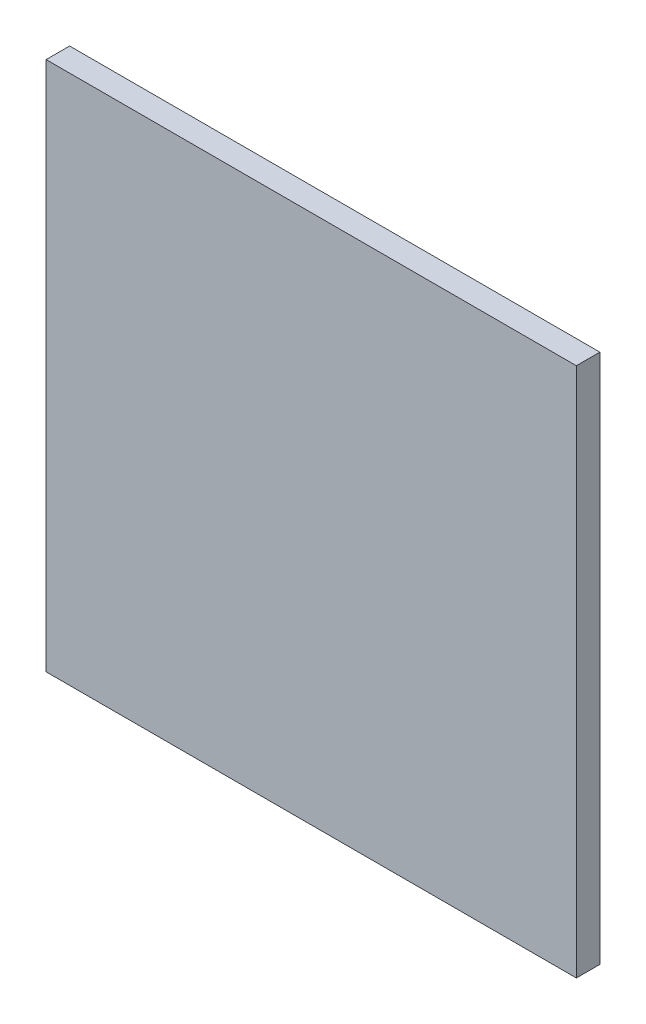
ISO-10303-21;
HEADER;
FILE_DESCRIPTION(('STEP AP214'),'2;1');
FILE_NAME('part.step','',(''),(''),'','','');
FILE_SCHEMA(('AUTOMOTIVE_DESIGN { 1 0 10303 214 1 1 1 1 }'));
ENDSEC;
DATA;
#1=APPLICATION_CONTEXT('core data for automotive mechanical design processes');
#2=APPLICATION_PROTOCOL_DEFINITION('international standard','automotive_design',2000,#1);
#3=PRODUCT_CONTEXT('',#1,'mechanical');
#4=PRODUCT('Part','Part','',(#3));
#5=PRODUCT_RELATED_PRODUCT_CATEGORY('part','',(#4));
#6=PRODUCT_DEFINITION_FORMATION('','',#4);
#7=PRODUCT_DEFINITION_CONTEXT('part definition',#1,'design');
#8=PRODUCT_DEFINITION('design','',#6,#7);
#9=PRODUCT_DEFINITION_SHAPE('','',#8);
#10=(LENGTH_UNIT() NAMED_UNIT(*) SI_UNIT(.MILLI.,.METRE.));
#11=(NAMED_UNIT(*) PLANE_ANGLE_UNIT() SI_UNIT($,.RADIAN.));
#12=(NAMED_UNIT(*) SI_UNIT($,.STERADIAN.) SOLID_ANGLE_UNIT());
#13=UNCERTAINTY_MEASURE_WITH_UNIT(LENGTH_MEASURE(1.E-05),#10,'distance_accuracy_value','');
#14=(GEOMETRIC_REPRESENTATION_CONTEXT(3) GLOBAL_UNCERTAINTY_ASSIGNED_CONTEXT((#13)) GLOBAL_UNIT_ASSIGNED_CONTEXT((#10,
#11,#12)) REPRESENTATION_CONTEXT('',''));
#15=CARTESIAN_POINT('',(0.,0.,0.));
#16=DIRECTION('',(0.,0.,1.));
#17=DIRECTION('',(1.,0.,0.));
#18=AXIS2_PLACEMENT_3D('',#15,#16,#17);
#19=CARTESIAN_POINT('',(5.07499874,5.07499874,0.4499991));
#20=DIRECTION('',(0.,0.,1.));
#21=DIRECTION('',(1.,0.,0.));
#22=AXIS2_PLACEMENT_3D('',#19,#20,#21);
#23=PLANE('',#22);
#24=DIRECTION('',(1.,0.,0.));
#25=VECTOR('',#24,1.);
#26=CARTESIAN_POINT('',(-5.07499874,5.07499874,0.4499991));
#27=LINE('',#26,#25);
#28=CARTESIAN_POINT('',(-5.07499874,5.07499874,0.4499991));
#29=VERTEX_POINT('',#28);
#30=CARTESIAN_POINT('',(5.07499874,5.07499874,0.4499991));
#31=VERTEX_POINT('',#30);
#32=EDGE_CURVE('E20',#29,#31,#27,.T.);
#33=ORIENTED_EDGE('',*,*,#32,.F.);
#34=DIRECTION('',(0.,1.,0.));
#35=VECTOR('',#34,1.);
#36=CARTESIAN_POINT('',(-5.07499874,-5.07499874,0.4499991));
#37=LINE('',#36,#35);
#38=CARTESIAN_POINT('',(-5.07499874,-5.07499874,0.4499991));
#39=VERTEX_POINT('',#38);
#40=EDGE_CURVE('E110',#39,#29,#37,.T.);
#41=ORIENTED_EDGE('',*,*,#40,.F.);
#42=DIRECTION('',(-1.,0.,0.));
#43=VECTOR('',#42,1.);
#44=CARTESIAN_POINT('',(5.07499874,-5.07499874,0.4499991));
#45=LINE('',#44,#43);
#46=CARTESIAN_POINT('',(5.07499874,-5.07499874,0.4499991));
#47=VERTEX_POINT('',#46);
#48=EDGE_CURVE('E83',#47,#39,#45,.T.);
#49=ORIENTED_EDGE('',*,*,#48,.F.);
#50=DIRECTION('',(0.,-1.,0.));
#51=VECTOR('',#50,1.);
#52=CARTESIAN_POINT('',(5.07499874,5.07499874,0.4499991));
#53=LINE('',#52,#51);
#54=EDGE_CURVE('E87',#31,#47,#53,.T.);
#55=ORIENTED_EDGE('',*,*,#54,.F.);
#56=EDGE_LOOP('',(#33,#41,#49,#55));
#57=FACE_BOUND('',#56,.T.);
#58=ADVANCED_FACE('F17',(#57),#23,.T.);
#59=CARTESIAN_POINT('',(5.07499874,5.07499874,0.));
#60=DIRECTION('',(0.,0.,1.));
#61=DIRECTION('',(1.,0.,0.));
#62=AXIS2_PLACEMENT_3D('',#59,#60,#61);
#63=PLANE('',#62);
#64=DIRECTION('',(0.,-1.,0.));
#65=VECTOR('',#64,1.);
#66=CARTESIAN_POINT('',(5.07499874,5.07499874,0.));
#67=LINE('',#66,#65);
#68=CARTESIAN_POINT('',(5.07499874,5.07499874,0.));
#69=VERTEX_POINT('',#68);
#70=CARTESIAN_POINT('',(5.07499874,-5.07499874,0.));
#71=VERTEX_POINT('',#70);
#72=EDGE_CURVE('E71',#69,#71,#67,.T.);
#73=ORIENTED_EDGE('',*,*,#72,.T.);
#74=DIRECTION('',(-1.,0.,0.));
#75=VECTOR('',#74,1.);
#76=CARTESIAN_POINT('',(5.07499874,-5.07499874,0.));
#77=LINE('',#76,#75);
#78=CARTESIAN_POINT('',(-5.07499874,-5.07499874,0.));
#79=VERTEX_POINT('',#78);
#80=EDGE_CURVE('E107',#71,#79,#77,.T.);
#81=ORIENTED_EDGE('',*,*,#80,.T.);
#82=DIRECTION('',(0.,1.,0.));
#83=VECTOR('',#82,1.);
#84=CARTESIAN_POINT('',(-5.07499874,-5.07499874,0.));
#85=LINE('',#84,#83);
#86=CARTESIAN_POINT('',(-5.07499874,5.07499874,0.));
#87=VERTEX_POINT('',#86);
#88=EDGE_CURVE('E73',#79,#87,#85,.T.);
#89=ORIENTED_EDGE('',*,*,#88,.T.);
#90=DIRECTION('',(1.,0.,0.));
#91=VECTOR('',#90,1.);
#92=CARTESIAN_POINT('',(-5.07499874,5.07499874,0.));
#93=LINE('',#92,#91);
#94=EDGE_CURVE('E11',#87,#69,#93,.T.);
#95=ORIENTED_EDGE('',*,*,#94,.T.);
#96=EDGE_LOOP('',(#73,#81,#89,#95));
#97=FACE_BOUND('',#96,.T.);
#98=ADVANCED_FACE('F69',(#97),#63,.F.);
#99=CARTESIAN_POINT('',(-5.07499874,5.07499874,0.));
#100=DIRECTION('',(0.,1.,0.));
#101=DIRECTION('',(1.,0.,0.));
#102=AXIS2_PLACEMENT_3D('',#99,#100,#101);
#103=PLANE('',#102);
#104=DIRECTION('',(0.,0.,1.));
#105=VECTOR('',#104,1.);
#106=CARTESIAN_POINT('',(-5.07499874,5.07499874,0.));
#107=LINE('',#106,#105);
#108=EDGE_CURVE('E97',#87,#29,#107,.T.);
#109=ORIENTED_EDGE('',*,*,#108,.T.);
#110=ORIENTED_EDGE('',*,*,#32,.T.);
#111=DIRECTION('',(0.,0.,1.));
#112=VECTOR('',#111,1.);
#113=CARTESIAN_POINT('',(5.07499874,5.07499874,0.));
#114=LINE('',#113,#112);
#115=EDGE_CURVE('E79',#69,#31,#114,.T.);
#116=ORIENTED_EDGE('',*,*,#115,.F.);
#117=ORIENTED_EDGE('',*,*,#94,.F.);
#118=EDGE_LOOP('',(#109,#110,#116,#117));
#119=FACE_BOUND('',#118,.T.);
#120=ADVANCED_FACE('F85',(#119),#103,.T.);
#121=CARTESIAN_POINT('',(-5.07499874,-5.07499874,0.));
#122=DIRECTION('',(-1.,0.,0.));
#123=DIRECTION('',(0.,0.,1.));
#124=AXIS2_PLACEMENT_3D('',#121,#122,#123);
#125=PLANE('',#124);
#126=DIRECTION('',(0.,0.,1.));
#127=VECTOR('',#126,1.);
#128=CARTESIAN_POINT('',(-5.07499874,-5.07499874,0.));
#129=LINE('',#128,#127);
#130=EDGE_CURVE('E103',#79,#39,#129,.T.);
#131=ORIENTED_EDGE('',*,*,#130,.T.);
#132=ORIENTED_EDGE('',*,*,#40,.T.);
#133=ORIENTED_EDGE('',*,*,#108,.F.);
#134=ORIENTED_EDGE('',*,*,#88,.F.);
#135=EDGE_LOOP('',(#131,#132,#133,#134));
#136=FACE_BOUND('',#135,.T.);
#137=ADVANCED_FACE('F117',(#136),#125,.T.);
#138=CARTESIAN_POINT('',(5.07499874,-5.07499874,0.));
#139=DIRECTION('',(0.,-1.,0.));
#140=DIRECTION('',(0.,0.,-1.));
#141=AXIS2_PLACEMENT_3D('',#138,#139,#140);
#142=PLANE('',#141);
#143=DIRECTION('',(0.,0.,1.));
#144=VECTOR('',#143,1.);
#145=CARTESIAN_POINT('',(5.07499874,-5.07499874,0.));
#146=LINE('',#145,#144);
#147=EDGE_CURVE('E81',#71,#47,#146,.T.);
#148=ORIENTED_EDGE('',*,*,#147,.T.);
#149=ORIENTED_EDGE('',*,*,#48,.T.);
#150=ORIENTED_EDGE('',*,*,#130,.F.);
#151=ORIENTED_EDGE('',*,*,#80,.F.);
#152=EDGE_LOOP('',(#148,#149,#150,#151));
#153=FACE_BOUND('',#152,.T.);
#154=ADVANCED_FACE('F120',(#153),#142,.T.);
#155=CARTESIAN_POINT('',(5.07499874,5.07499874,0.));
#156=DIRECTION('',(1.,0.,0.));
#157=DIRECTION('',(0.,1.,0.));
#158=AXIS2_PLACEMENT_3D('',#155,#156,#157);
#159=PLANE('',#158);
#160=ORIENTED_EDGE('',*,*,#115,.T.);
#161=ORIENTED_EDGE('',*,*,#54,.T.);
#162=ORIENTED_EDGE('',*,*,#147,.F.);
#163=ORIENTED_EDGE('',*,*,#72,.F.);
#164=EDGE_LOOP('',(#160,#161,#162,#163));
#165=FACE_BOUND('',#164,.T.);
#166=ADVANCED_FACE('F77',(#165),#159,.T.);
#167=CLOSED_SHELL('',(#58,#98,#120,#137,#154,#166));
#168=MANIFOLD_SOLID_BREP('B1',#167);
#169=ADVANCED_BREP_SHAPE_REPRESENTATION('',(#18,#168),#14);
#170=SHAPE_DEFINITION_REPRESENTATION(#9,#169);
ENDSEC;
END-ISO-10303-21;
